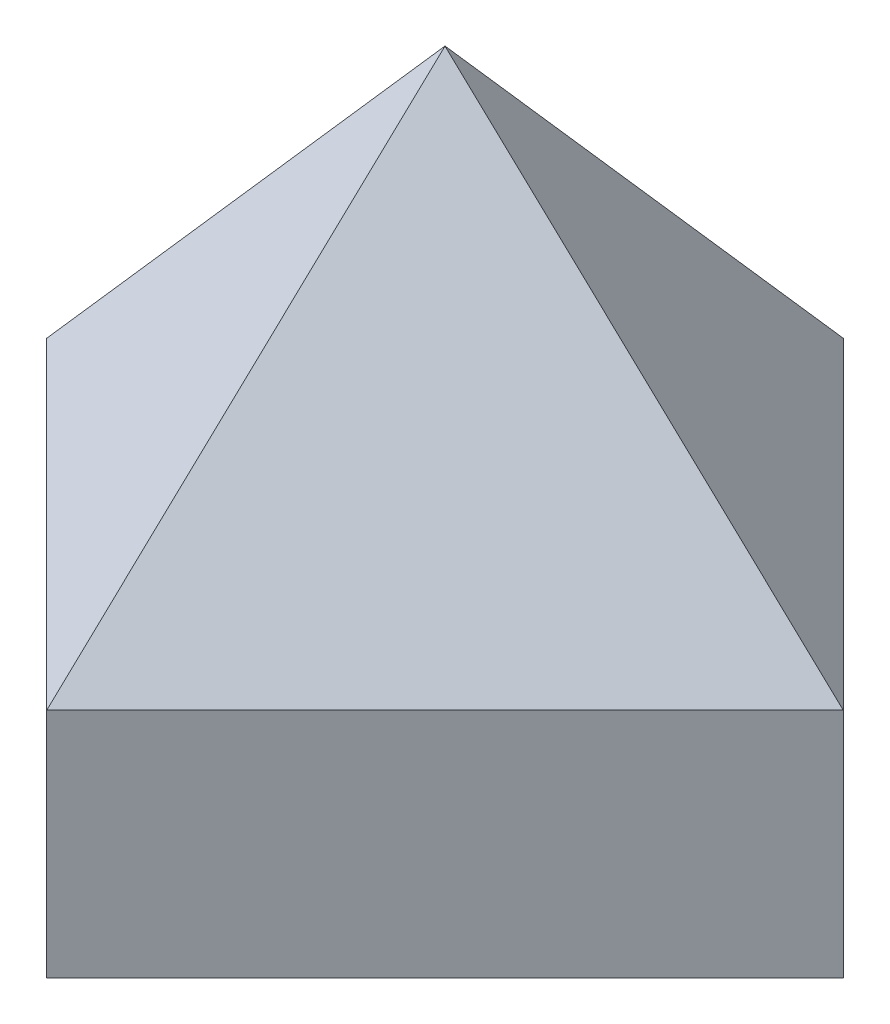
ISO-10303-21;
HEADER;
FILE_DESCRIPTION(('STEP AP214'),'2;1');
FILE_NAME('part.step','',(''),(''),'','','');
FILE_SCHEMA(('AUTOMOTIVE_DESIGN { 1 0 10303 214 1 1 1 1 }'));
ENDSEC;
DATA;
#1=APPLICATION_CONTEXT('core data for automotive mechanical design processes');
#2=APPLICATION_PROTOCOL_DEFINITION('international standard','automotive_design',2000,#1);
#3=PRODUCT_CONTEXT('',#1,'mechanical');
#4=PRODUCT('Part','Part','',(#3));
#5=PRODUCT_RELATED_PRODUCT_CATEGORY('part','',(#4));
#6=PRODUCT_DEFINITION_FORMATION('','',#4);
#7=PRODUCT_DEFINITION_CONTEXT('part definition',#1,'design');
#8=PRODUCT_DEFINITION('design','',#6,#7);
#9=PRODUCT_DEFINITION_SHAPE('','',#8);
#10=(LENGTH_UNIT() NAMED_UNIT(*) SI_UNIT(.MILLI.,.METRE.));
#11=(NAMED_UNIT(*) PLANE_ANGLE_UNIT() SI_UNIT($,.RADIAN.));
#12=(NAMED_UNIT(*) SI_UNIT($,.STERADIAN.) SOLID_ANGLE_UNIT());
#13=UNCERTAINTY_MEASURE_WITH_UNIT(LENGTH_MEASURE(1.E-05),#10,'distance_accuracy_value','');
#14=(GEOMETRIC_REPRESENTATION_CONTEXT(3) GLOBAL_UNCERTAINTY_ASSIGNED_CONTEXT((#13)) GLOBAL_UNIT_ASSIGNED_CONTEXT((#10,
#11,#12)) REPRESENTATION_CONTEXT('',''));
#15=CARTESIAN_POINT('',(0.,0.,0.));
#16=DIRECTION('',(0.,0.,1.));
#17=DIRECTION('',(1.,0.,0.));
#18=AXIS2_PLACEMENT_3D('',#15,#16,#17);
#19=CARTESIAN_POINT('',(-83.6112051113504,28.,58.0832611206852));
#20=DIRECTION('',(0.707106781186547,0.,0.707106781186547));
#21=DIRECTION('',(0.707106781186548,0.,-0.707106781186548));
#22=AXIS2_PLACEMENT_3D('',#19,#20,#21);
#23=PLANE('',#22);
#24=DIRECTION('',(-0.707106781186548,0.,0.707106781186548));
#25=VECTOR('',#24,1.);
#26=CARTESIAN_POINT('',(-83.6112051113504,0.,58.0832611206852));
#27=LINE('',#26,#25);
#28=CARTESIAN_POINT('',(-35.5279439906652,0.,10.));
#29=VERTEX_POINT('',#28);
#30=CARTESIAN_POINT('',(-83.6112051113504,0.,58.0832611206852));
#31=VERTEX_POINT('',#30);
#32=EDGE_CURVE('E111',#29,#31,#27,.T.);
#33=ORIENTED_EDGE('',*,*,#32,.T.);
#34=DIRECTION('',(0.,-1.,0.));
#35=VECTOR('',#34,1.);
#36=CARTESIAN_POINT('',(-83.6112051113504,28.,58.0832611206852));
#37=LINE('',#36,#35);
#38=CARTESIAN_POINT('',(-83.6112051113504,28.,58.0832611206852));
#39=VERTEX_POINT('',#38);
#40=EDGE_CURVE('E12',#39,#31,#37,.T.);
#41=ORIENTED_EDGE('',*,*,#40,.F.);
#42=DIRECTION('',(-0.707106781186548,0.,0.707106781186548));
#43=VECTOR('',#42,1.);
#44=CARTESIAN_POINT('',(-59.5695745510078,28.,34.0416305603426));
#45=LINE('',#44,#43);
#46=CARTESIAN_POINT('',(-35.5279439906652,28.,10.));
#47=VERTEX_POINT('',#46);
#48=EDGE_CURVE('E89',#47,#39,#45,.T.);
#49=ORIENTED_EDGE('',*,*,#48,.F.);
#50=DIRECTION('',(0.,-1.,0.));
#51=VECTOR('',#50,1.);
#52=CARTESIAN_POINT('',(-35.5279439906652,28.,10.));
#53=LINE('',#52,#51);
#54=EDGE_CURVE('E91',#47,#29,#53,.T.);
#55=ORIENTED_EDGE('',*,*,#54,.T.);
#56=EDGE_LOOP('',(#33,#41,#49,#55));
#57=FACE_BOUND('',#56,.T.);
#58=ADVANCED_FACE('F34',(#57),#23,.F.);
#59=CARTESIAN_POINT('',(-44.7203321460903,28.,96.9741340859453));
#60=DIRECTION('',(0.707106781186548,0.,-0.707106781186548));
#61=DIRECTION('',(-0.707106781186547,0.,-0.707106781186548));
#62=AXIS2_PLACEMENT_3D('',#59,#60,#61);
#63=PLANE('',#62);
#64=DIRECTION('',(0.707106781186547,0.,0.707106781186548));
#65=VECTOR('',#64,1.);
#66=CARTESIAN_POINT('',(-44.7203321460903,0.,96.9741340859453));
#67=LINE('',#66,#65);
#68=CARTESIAN_POINT('',(-44.7203321460903,0.,96.9741340859453));
#69=VERTEX_POINT('',#68);
#70=EDGE_CURVE('E118',#31,#69,#67,.T.);
#71=ORIENTED_EDGE('',*,*,#70,.T.);
#72=DIRECTION('',(0.,-1.,0.));
#73=VECTOR('',#72,1.);
#74=CARTESIAN_POINT('',(-44.7203321460903,28.,96.9741340859453));
#75=LINE('',#74,#73);
#76=CARTESIAN_POINT('',(-44.7203321460903,28.,96.9741340859453));
#77=VERTEX_POINT('',#76);
#78=EDGE_CURVE('E43',#77,#69,#75,.T.);
#79=ORIENTED_EDGE('',*,*,#78,.F.);
#80=DIRECTION('',(0.707106781186548,0.,0.707106781186548));
#81=VECTOR('',#80,1.);
#82=CARTESIAN_POINT('',(-83.6112051113504,28.,58.0832611206852));
#83=LINE('',#82,#81);
#84=EDGE_CURVE('E37',#39,#77,#83,.T.);
#85=ORIENTED_EDGE('',*,*,#84,.F.);
#86=ORIENTED_EDGE('',*,*,#40,.T.);
#87=EDGE_LOOP('',(#71,#79,#85,#86));
#88=FACE_BOUND('',#87,.T.);
#89=ADVANCED_FACE('F139',(#88),#63,.F.);
#90=CARTESIAN_POINT('',(3.36292897459495,28.,48.8908729652601));
#91=DIRECTION('',(-0.707106781186547,0.,-0.707106781186548));
#92=DIRECTION('',(-0.707106781186548,0.,0.707106781186547));
#93=AXIS2_PLACEMENT_3D('',#90,#91,#92);
#94=PLANE('',#93);
#95=DIRECTION('',(0.707106781186548,0.,-0.707106781186547));
#96=VECTOR('',#95,1.);
#97=CARTESIAN_POINT('',(3.36292897459495,0.,48.8908729652601));
#98=LINE('',#97,#96);
#99=CARTESIAN_POINT('',(3.36292897459495,0.,48.8908729652601));
#100=VERTEX_POINT('',#99);
#101=EDGE_CURVE('E120',#69,#100,#98,.T.);
#102=ORIENTED_EDGE('',*,*,#101,.T.);
#103=DIRECTION('',(0.,-1.,0.));
#104=VECTOR('',#103,1.);
#105=CARTESIAN_POINT('',(3.36292897459495,28.,48.8908729652601));
#106=LINE('',#105,#104);
#107=CARTESIAN_POINT('',(3.36292897459494,28.,48.8908729652601));
#108=VERTEX_POINT('',#107);
#109=EDGE_CURVE('E51',#108,#100,#106,.T.);
#110=ORIENTED_EDGE('',*,*,#109,.F.);
#111=DIRECTION('',(0.707106781186547,0.,-0.707106781186547));
#112=VECTOR('',#111,1.);
#113=CARTESIAN_POINT('',(-20.6787015857477,28.,72.9325035256027));
#114=LINE('',#113,#112);
#115=EDGE_CURVE('E105',#77,#108,#114,.T.);
#116=ORIENTED_EDGE('',*,*,#115,.F.);
#117=ORIENTED_EDGE('',*,*,#78,.T.);
#118=EDGE_LOOP('',(#102,#110,#116,#117));
#119=FACE_BOUND('',#118,.T.);
#120=ADVANCED_FACE('F143',(#119),#94,.F.);
#121=CARTESIAN_POINT('',(-35.5279439906652,28.,10.));
#122=DIRECTION('',(-0.707106781186548,0.,0.707106781186548));
#123=DIRECTION('',(0.707106781186548,0.,0.707106781186547));
#124=AXIS2_PLACEMENT_3D('',#121,#122,#123);
#125=PLANE('',#124);
#126=DIRECTION('',(-0.707106781186548,0.,-0.707106781186547));
#127=VECTOR('',#126,1.);
#128=CARTESIAN_POINT('',(-35.5279439906652,0.,10.));
#129=LINE('',#128,#127);
#130=EDGE_CURVE('E68',#100,#29,#129,.T.);
#131=ORIENTED_EDGE('',*,*,#130,.T.);
#132=ORIENTED_EDGE('',*,*,#54,.F.);
#133=DIRECTION('',(-0.707106781186548,0.,-0.707106781186548));
#134=VECTOR('',#133,1.);
#135=CARTESIAN_POINT('',(3.36292897459495,28.,48.8908729652601));
#136=LINE('',#135,#134);
#137=EDGE_CURVE('E100',#108,#47,#136,.T.);
#138=ORIENTED_EDGE('',*,*,#137,.F.);
#139=ORIENTED_EDGE('',*,*,#109,.T.);
#140=EDGE_LOOP('',(#131,#132,#138,#139));
#141=FACE_BOUND('',#140,.T.);
#142=ADVANCED_FACE('F99',(#141),#125,.F.);
#143=CARTESIAN_POINT('',(-35.5279439906652,0.,10.));
#144=DIRECTION('',(0.,-1.,0.));
#145=DIRECTION('',(0.,0.,-1.));
#146=AXIS2_PLACEMENT_3D('',#143,#144,#145);
#147=PLANE('',#146);
#148=ORIENTED_EDGE('',*,*,#32,.F.);
#149=ORIENTED_EDGE('',*,*,#130,.F.);
#150=ORIENTED_EDGE('',*,*,#101,.F.);
#151=ORIENTED_EDGE('',*,*,#70,.F.);
#152=EDGE_LOOP('',(#148,#149,#150,#151));
#153=FACE_BOUND('',#152,.T.);
#154=ADVANCED_FACE('F130',(#153),#147,.T.);
#155=CARTESIAN_POINT('',(-40.1241380683777,78.,53.4870670429727));
#156=DIRECTION('',(-0.61957821080879,0.481918749772156,-0.61957821080879));
#157=DIRECTION('',(-0.707106781186548,0.,0.707106781186548));
#158=AXIS2_PLACEMENT_3D('',#155,#156,#157);
#159=PLANE('',#158);
#160=DIRECTION('',(0.0691939786007362,-0.752731253628575,-0.654681489837734));
#161=VECTOR('',#160,1.);
#162=CARTESIAN_POINT('',(-40.1241380683777,78.,53.4870670429727));
#163=LINE('',#162,#161);
#164=CARTESIAN_POINT('',(-40.1241380683777,78.,53.4870670429727));
#165=VERTEX_POINT('',#164);
#166=EDGE_CURVE('E104',#165,#47,#163,.T.);
#167=ORIENTED_EDGE('',*,*,#166,.T.);
#168=ORIENTED_EDGE('',*,*,#48,.T.);
#169=DIRECTION('',(-0.654681489837734,-0.752731253628575,0.0691939786007361));
#170=VECTOR('',#169,1.);
#171=CARTESIAN_POINT('',(-40.1241380683777,78.,53.4870670429727));
#172=LINE('',#171,#170);
#173=EDGE_CURVE('E108',#165,#39,#172,.T.);
#174=ORIENTED_EDGE('',*,*,#173,.F.);
#175=EDGE_LOOP('',(#167,#168,#174));
#176=FACE_BOUND('',#175,.T.);
#177=ADVANCED_FACE('F107',(#176),#159,.T.);
#178=CARTESIAN_POINT('',(-83.6112051113504,28.,58.0832611206852));
#179=DIRECTION('',(-0.584725337156235,0.562310021407279,0.584725337156235));
#180=DIRECTION('',(0.707106781186548,0.,0.707106781186548));
#181=AXIS2_PLACEMENT_3D('',#178,#179,#180);
#182=PLANE('',#181);
#183=ORIENTED_EDGE('',*,*,#173,.T.);
#184=ORIENTED_EDGE('',*,*,#84,.T.);
#185=DIRECTION('',(-0.0691939786007362,-0.752731253628575,0.654681489837734));
#186=VECTOR('',#185,1.);
#187=CARTESIAN_POINT('',(-40.1241380683777,78.,53.4870670429727));
#188=LINE('',#187,#186);
#189=EDGE_CURVE('E113',#165,#77,#188,.T.);
#190=ORIENTED_EDGE('',*,*,#189,.F.);
#191=EDGE_LOOP('',(#183,#184,#190));
#192=FACE_BOUND('',#191,.T.);
#193=ADVANCED_FACE('F126',(#192),#182,.T.);
#194=CARTESIAN_POINT('',(3.36292897459495,28.,48.8908729652601));
#195=DIRECTION('',(0.584725337156235,0.562310021407279,-0.584725337156235));
#196=DIRECTION('',(-0.707106781186548,0.,-0.707106781186548));
#197=AXIS2_PLACEMENT_3D('',#194,#195,#196);
#198=PLANE('',#197);
#199=DIRECTION('',(0.654681489837734,-0.752731253628575,-0.0691939786007362));
#200=VECTOR('',#199,1.);
#201=CARTESIAN_POINT('',(-40.1241380683777,78.,53.4870670429727));
#202=LINE('',#201,#200);
#203=EDGE_CURVE('E84',#165,#108,#202,.T.);
#204=ORIENTED_EDGE('',*,*,#203,.T.);
#205=ORIENTED_EDGE('',*,*,#137,.T.);
#206=ORIENTED_EDGE('',*,*,#166,.F.);
#207=EDGE_LOOP('',(#204,#205,#206));
#208=FACE_BOUND('',#207,.T.);
#209=ADVANCED_FACE('F103',(#208),#198,.T.);
#210=CARTESIAN_POINT('',(-40.1241380683777,78.,53.4870670429727));
#211=DIRECTION('',(0.61957821080879,0.481918749772156,0.61957821080879));
#212=DIRECTION('',(0.707106781186547,0.,-0.707106781186547));
#213=AXIS2_PLACEMENT_3D('',#210,#211,#212);
#214=PLANE('',#213);
#215=ORIENTED_EDGE('',*,*,#189,.T.);
#216=ORIENTED_EDGE('',*,*,#115,.T.);
#217=ORIENTED_EDGE('',*,*,#203,.F.);
#218=EDGE_LOOP('',(#215,#216,#217));
#219=FACE_BOUND('',#218,.T.);
#220=ADVANCED_FACE('F127',(#219),#214,.T.);
#221=CLOSED_SHELL('',(#58,#89,#120,#142,#154,#177,#193,#209,#220));
#222=MANIFOLD_SOLID_BREP('B2',#221);
#223=ADVANCED_BREP_SHAPE_REPRESENTATION('',(#18,#222),#14);
#224=SHAPE_DEFINITION_REPRESENTATION(#9,#223);
ENDSEC;
END-ISO-10303-21;
